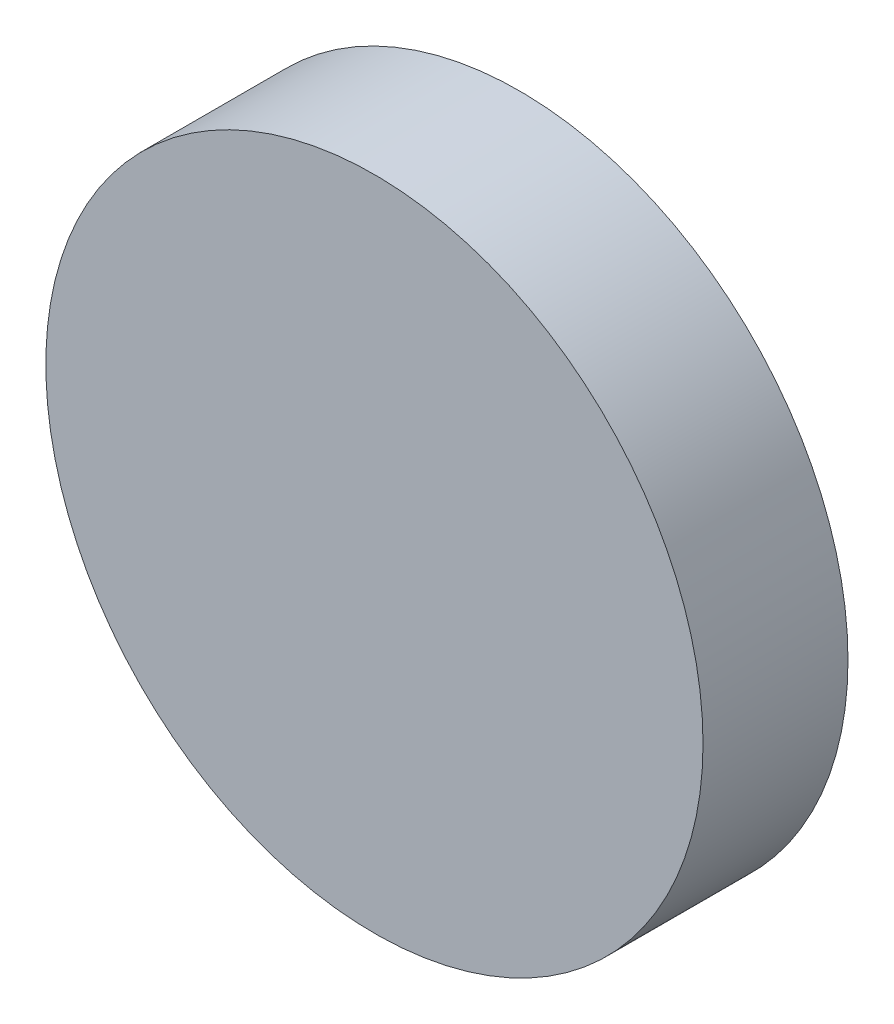
ISO-10303-21;
HEADER;
FILE_DESCRIPTION(('STEP AP214'),'2;1');
FILE_NAME('part.step','',(''),(''),'','','');
FILE_SCHEMA(('AUTOMOTIVE_DESIGN { 1 0 10303 214 1 1 1 1 }'));
ENDSEC;
DATA;
#1=APPLICATION_CONTEXT('core data for automotive mechanical design processes');
#2=APPLICATION_PROTOCOL_DEFINITION('international standard','automotive_design',2000,#1);
#3=PRODUCT_CONTEXT('',#1,'mechanical');
#4=PRODUCT('Part','Part','',(#3));
#5=PRODUCT_RELATED_PRODUCT_CATEGORY('part','',(#4));
#6=PRODUCT_DEFINITION_FORMATION('','',#4);
#7=PRODUCT_DEFINITION_CONTEXT('part definition',#1,'design');
#8=PRODUCT_DEFINITION('design','',#6,#7);
#9=PRODUCT_DEFINITION_SHAPE('','',#8);
#10=(LENGTH_UNIT() NAMED_UNIT(*) SI_UNIT(.MILLI.,.METRE.));
#11=(NAMED_UNIT(*) PLANE_ANGLE_UNIT() SI_UNIT($,.RADIAN.));
#12=(NAMED_UNIT(*) SI_UNIT($,.STERADIAN.) SOLID_ANGLE_UNIT());
#13=UNCERTAINTY_MEASURE_WITH_UNIT(LENGTH_MEASURE(1.E-05),#10,'distance_accuracy_value','');
#14=(GEOMETRIC_REPRESENTATION_CONTEXT(3) GLOBAL_UNCERTAINTY_ASSIGNED_CONTEXT((#13)) GLOBAL_UNIT_ASSIGNED_CONTEXT((#10,
#11,#12)) REPRESENTATION_CONTEXT('',''));
#15=CARTESIAN_POINT('',(0.,0.,0.));
#16=DIRECTION('',(0.,0.,1.));
#17=DIRECTION('',(1.,0.,0.));
#18=AXIS2_PLACEMENT_3D('',#15,#16,#17);
#19=CARTESIAN_POINT('',(0.,0.,0.9));
#20=DIRECTION('',(0.,0.,-1.));
#21=DIRECTION('',(-1.,0.,0.));
#22=AXIS2_PLACEMENT_3D('',#19,#20,#21);
#23=CYLINDRICAL_SURFACE('',#22,2.04);
#24=CARTESIAN_POINT('',(0.,0.,0.9));
#25=DIRECTION('',(0.,0.,1.));
#26=DIRECTION('',(1.,0.,0.));
#27=AXIS2_PLACEMENT_3D('',#24,#25,#26);
#28=CIRCLE('',#27,2.04);
#29=CARTESIAN_POINT('',(2.04,0.,0.9));
#30=VERTEX_POINT('',#29);
#31=EDGE_CURVE('E10',#30,#30,#28,.T.);
#32=ORIENTED_EDGE('',*,*,#31,.F.);
#33=EDGE_LOOP('',(#32));
#34=FACE_BOUND('',#33,.T.);
#35=CARTESIAN_POINT('',(0.,0.,0.));
#36=DIRECTION('',(0.,0.,1.));
#37=DIRECTION('',(1.,0.,0.));
#38=AXIS2_PLACEMENT_3D('',#35,#36,#37);
#39=CIRCLE('',#38,2.04);
#40=CARTESIAN_POINT('',(2.04,0.,0.));
#41=VERTEX_POINT('',#40);
#42=EDGE_CURVE('E34',#41,#41,#39,.T.);
#43=ORIENTED_EDGE('',*,*,#42,.T.);
#44=EDGE_LOOP('',(#43));
#45=FACE_BOUND('',#44,.T.);
#46=ADVANCED_FACE('F31',(#34,#45),#23,.T.);
#47=CARTESIAN_POINT('',(0.,0.,0.9));
#48=DIRECTION('',(0.,0.,1.));
#49=DIRECTION('',(1.,0.,0.));
#50=AXIS2_PLACEMENT_3D('',#47,#48,#49);
#51=PLANE('',#50);
#52=ORIENTED_EDGE('',*,*,#31,.T.);
#53=EDGE_LOOP('',(#52));
#54=FACE_BOUND('',#53,.T.);
#55=ADVANCED_FACE('F46',(#54),#51,.T.);
#56=CARTESIAN_POINT('',(0.,0.,0.));
#57=DIRECTION('',(0.,0.,1.));
#58=DIRECTION('',(1.,0.,0.));
#59=AXIS2_PLACEMENT_3D('',#56,#57,#58);
#60=PLANE('',#59);
#61=ORIENTED_EDGE('',*,*,#42,.F.);
#62=EDGE_LOOP('',(#61));
#63=FACE_BOUND('',#62,.T.);
#64=ADVANCED_FACE('F44',(#63),#60,.F.);
#65=CLOSED_SHELL('',(#46,#55,#64));
#66=MANIFOLD_SOLID_BREP('B2',#65);
#67=ADVANCED_BREP_SHAPE_REPRESENTATION('',(#18,#66),#14);
#68=SHAPE_DEFINITION_REPRESENTATION(#9,#67);
ENDSEC;
END-ISO-10303-21;
